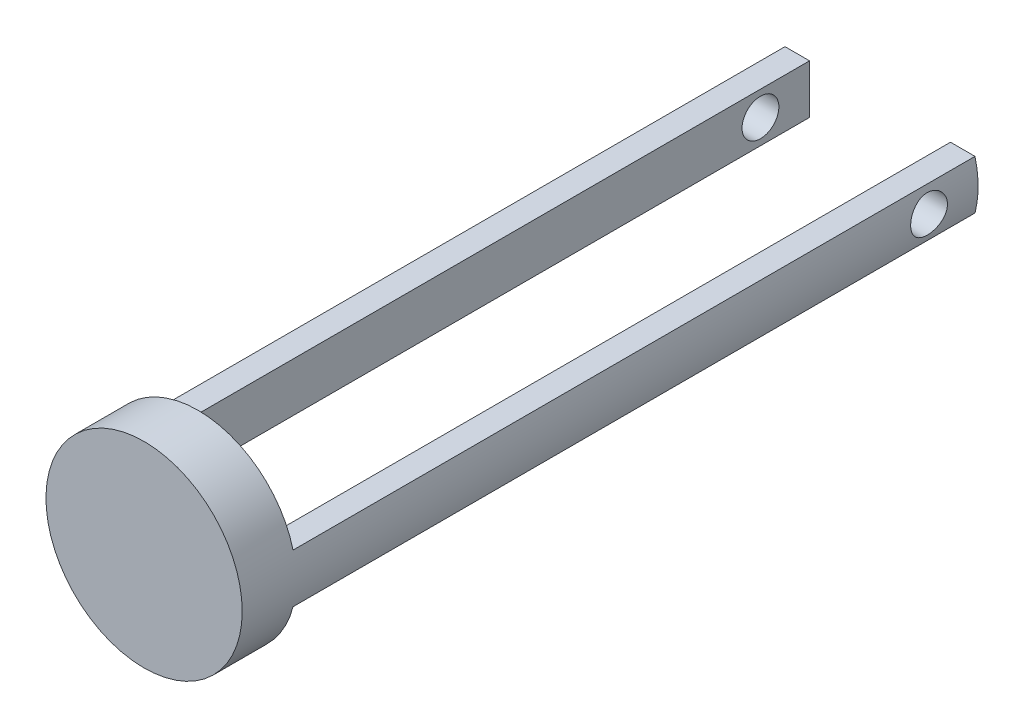
ISO-10303-21;
HEADER;
FILE_DESCRIPTION(('STEP AP214'),'2;1');
FILE_NAME('part.step','',(''),(''),'','','');
FILE_SCHEMA(('AUTOMOTIVE_DESIGN { 1 0 10303 214 1 1 1 1 }'));
ENDSEC;
DATA;
#1=APPLICATION_CONTEXT('core data for automotive mechanical design processes');
#2=APPLICATION_PROTOCOL_DEFINITION('international standard','automotive_design',2000,#1);
#3=PRODUCT_CONTEXT('',#1,'mechanical');
#4=PRODUCT('Part','Part','',(#3));
#5=PRODUCT_RELATED_PRODUCT_CATEGORY('part','',(#4));
#6=PRODUCT_DEFINITION_FORMATION('','',#4);
#7=PRODUCT_DEFINITION_CONTEXT('part definition',#1,'design');
#8=PRODUCT_DEFINITION('design','',#6,#7);
#9=PRODUCT_DEFINITION_SHAPE('','',#8);
#10=(LENGTH_UNIT() NAMED_UNIT(*) SI_UNIT(.MILLI.,.METRE.));
#11=(NAMED_UNIT(*) PLANE_ANGLE_UNIT() SI_UNIT($,.RADIAN.));
#12=(NAMED_UNIT(*) SI_UNIT($,.STERADIAN.) SOLID_ANGLE_UNIT());
#13=UNCERTAINTY_MEASURE_WITH_UNIT(LENGTH_MEASURE(1.E-05),#10,'distance_accuracy_value','');
#14=(GEOMETRIC_REPRESENTATION_CONTEXT(3) GLOBAL_UNCERTAINTY_ASSIGNED_CONTEXT((#13)) GLOBAL_UNIT_ASSIGNED_CONTEXT((#10,
#11,#12)) REPRESENTATION_CONTEXT('',''));
#15=CARTESIAN_POINT('',(0.,0.,0.));
#16=DIRECTION('',(0.,0.,1.));
#17=DIRECTION('',(1.,0.,0.));
#18=AXIS2_PLACEMENT_3D('',#15,#16,#17);
#19=CARTESIAN_POINT('',(0.,0.,0.));
#20=DIRECTION('',(0.,0.,1.));
#21=DIRECTION('',(1.,0.,0.));
#22=AXIS2_PLACEMENT_3D('',#19,#20,#21);
#23=PLANE('',#22);
#24=DIRECTION('',(1.,0.,0.));
#25=VECTOR('',#24,1.);
#26=CARTESIAN_POINT('',(-49.1868884968342,12.7,0.));
#27=LINE('',#26,#25);
#28=CARTESIAN_POINT('',(-49.1868884968342,12.7,0.));
#29=VERTEX_POINT('',#28);
#30=CARTESIAN_POINT('',(-36.4868884968342,12.7,0.));
#31=VERTEX_POINT('',#30);
#32=EDGE_CURVE('E291',#29,#31,#27,.T.);
#33=ORIENTED_EDGE('',*,*,#32,.F.);
#34=CARTESIAN_POINT('',(0.,0.,0.));
#35=DIRECTION('',(0.,0.,1.));
#36=DIRECTION('',(1.,0.,0.));
#37=AXIS2_PLACEMENT_3D('',#34,#35,#36);
#38=CIRCLE('',#37,50.8);
#39=CARTESIAN_POINT('',(49.1868884968342,12.7,0.));
#40=VERTEX_POINT('',#39);
#41=EDGE_CURVE('E43',#40,#29,#38,.T.);
#42=ORIENTED_EDGE('',*,*,#41,.F.);
#43=DIRECTION('',(1.,0.,0.));
#44=VECTOR('',#43,1.);
#45=CARTESIAN_POINT('',(49.1868884968342,12.7,0.));
#46=LINE('',#45,#44);
#47=CARTESIAN_POINT('',(36.4868884968342,12.7,0.));
#48=VERTEX_POINT('',#47);
#49=EDGE_CURVE('E59',#48,#40,#46,.T.);
#50=ORIENTED_EDGE('',*,*,#49,.F.);
#51=DIRECTION('',(0.,1.,0.));
#52=VECTOR('',#51,1.);
#53=CARTESIAN_POINT('',(36.4868884968342,12.7,0.));
#54=LINE('',#53,#52);
#55=CARTESIAN_POINT('',(36.4868884968342,-12.7,0.));
#56=VERTEX_POINT('',#55);
#57=EDGE_CURVE('E124',#56,#48,#54,.T.);
#58=ORIENTED_EDGE('',*,*,#57,.F.);
#59=DIRECTION('',(-1.,0.,0.));
#60=VECTOR('',#59,1.);
#61=CARTESIAN_POINT('',(36.4868884968342,-12.7,0.));
#62=LINE('',#61,#60);
#63=CARTESIAN_POINT('',(49.1868884968342,-12.7,0.));
#64=VERTEX_POINT('',#63);
#65=EDGE_CURVE('E121',#64,#56,#62,.T.);
#66=ORIENTED_EDGE('',*,*,#65,.F.);
#67=CARTESIAN_POINT('',(-49.1868884968342,-12.7,0.));
#68=VERTEX_POINT('',#67);
#69=EDGE_CURVE('E151',#68,#64,#38,.T.);
#70=ORIENTED_EDGE('',*,*,#69,.F.);
#71=DIRECTION('',(-1.,0.,0.));
#72=VECTOR('',#71,1.);
#73=CARTESIAN_POINT('',(-36.4868884968342,-12.7,0.));
#74=LINE('',#73,#72);
#75=CARTESIAN_POINT('',(-36.4868884968342,-12.7,0.));
#76=VERTEX_POINT('',#75);
#77=EDGE_CURVE('E117',#76,#68,#74,.T.);
#78=ORIENTED_EDGE('',*,*,#77,.F.);
#79=DIRECTION('',(0.,-1.,0.));
#80=VECTOR('',#79,1.);
#81=CARTESIAN_POINT('',(-36.4868884968342,12.7,0.));
#82=LINE('',#81,#80);
#83=EDGE_CURVE('E296',#31,#76,#82,.T.);
#84=ORIENTED_EDGE('',*,*,#83,.F.);
#85=EDGE_LOOP('',(#33,#42,#50,#58,#66,#70,#78,#84));
#86=FACE_BOUND('',#85,.T.);
#87=ADVANCED_FACE('F33',(#86),#23,.F.);
#88=CARTESIAN_POINT('',(0.,0.,27.94));
#89=DIRECTION('',(0.,0.,-1.));
#90=DIRECTION('',(-1.,0.,0.));
#91=AXIS2_PLACEMENT_3D('',#88,#89,#90);
#92=CYLINDRICAL_SURFACE('',#91,50.8);
#93=CARTESIAN_POINT('',(-50.8,0.,-337.185));
#94=CARTESIAN_POINT('',(-50.8000023043984,0.265112508847247,-337.185004788771));
#95=CARTESIAN_POINT('',(-50.797920970951,0.530163183869242,-337.173928461929));
#96=CARTESIAN_POINT('',(-50.7896587686576,1.05843450705729,-337.129718641948));
#97=CARTESIAN_POINT('',(-50.7834771603281,1.32165481646295,-337.096581170084));
#98=CARTESIAN_POINT('',(-50.7671781209653,1.84448038090153,-337.008468416572));
#99=CARTESIAN_POINT('',(-50.7570577920175,2.10408282808436,-336.95347705529));
#100=CARTESIAN_POINT('',(-50.7331648032312,2.6176454114376,-336.822085315767));
#101=CARTESIAN_POINT('',(-50.7193920765346,2.87160544422974,-336.745684545618));
#102=CARTESIAN_POINT('',(-50.688591382839,3.37186240146238,-336.572137803644));
#103=CARTESIAN_POINT('',(-50.6715664616592,3.61816624726249,-336.475011232531));
#104=CARTESIAN_POINT('',(-50.6347225267335,4.10166609552222,-336.260691124805));
#105=CARTESIAN_POINT('',(-50.6149034853259,4.33886200778397,-336.143497389524));
#106=CARTESIAN_POINT('',(-50.5730208007042,4.80247152155046,-335.889925997398));
#107=CARTESIAN_POINT('',(-50.5509577817929,5.02888809640677,-335.753553672258));
#108=CARTESIAN_POINT('',(-50.5051766338902,5.46957355155657,-335.462508828752));
#109=CARTESIAN_POINT('',(-50.4814579186527,5.68383807990406,-335.307829814764));
#110=CARTESIAN_POINT('',(-50.4327680579375,6.10085539778906,-334.979585027289));
#111=CARTESIAN_POINT('',(-50.407786507427,6.30346644002778,-334.805840691591));
#112=CARTESIAN_POINT('',(-50.3574838953207,6.69346707062095,-334.441909282304));
#113=CARTESIAN_POINT('',(-50.3321626843611,6.88084968844636,-334.251714760257));
#114=CARTESIAN_POINT('',(-50.2818970109564,7.2390296240496,-333.856229101085));
#115=CARTESIAN_POINT('',(-50.2569525763597,7.4098257209028,-333.650936854577));
#116=CARTESIAN_POINT('',(-50.2081543813486,7.73356504785847,-333.226753919925));
#117=CARTESIAN_POINT('',(-50.1843001322999,7.88651632492305,-333.007869429846));
#118=CARTESIAN_POINT('',(-50.1381535039642,8.17478181829502,-332.556016888366));
#119=CARTESIAN_POINT('',(-50.1158758542568,8.30993784567323,-332.32294636858));
#120=CARTESIAN_POINT('',(-50.073760985975,8.56005533230363,-331.846111783907));
#121=CARTESIAN_POINT('',(-50.0539228358011,8.67502450776012,-331.602351849652));
#122=CARTESIAN_POINT('',(-50.0172588040603,8.88397902900869,-331.105739568071));
#123=CARTESIAN_POINT('',(-50.000433308317,8.9779616874875,-330.852886061124));
#124=CARTESIAN_POINT('',(-49.9702997106796,9.14419435550265,-330.339929307469));
#125=CARTESIAN_POINT('',(-49.9569915629724,9.21644464810364,-330.079826155235));
#126=CARTESIAN_POINT('',(-49.9344250561705,9.33793182357615,-329.557305238289));
#127=CARTESIAN_POINT('',(-49.9251216274816,9.38742527149658,-329.294949061266));
#128=CARTESIAN_POINT('',(-49.910619554215,9.46422671721475,-328.766896539154));
#129=CARTESIAN_POINT('',(-49.9054208811112,9.4915348691906,-328.501200217289));
#130=CARTESIAN_POINT('',(-49.8992841058544,9.52374484120453,-327.968424737124));
#131=CARTESIAN_POINT('',(-49.8983456679073,9.52864842718343,-327.701345689472));
#132=CARTESIAN_POINT('',(-49.9007566535589,9.51601423280106,-327.167739498825));
#133=CARTESIAN_POINT('',(-49.9041060459689,9.49847661567283,-326.90121235183));
#134=CARTESIAN_POINT('',(-49.9149201445867,9.44148142726203,-326.374160137933));
#135=CARTESIAN_POINT('',(-49.9223299738237,9.4023161019449,-326.113602276199));
#136=CARTESIAN_POINT('',(-49.9410115252385,9.30257696494227,-325.59676126616));
#137=CARTESIAN_POINT('',(-49.952283208258,9.24200337033154,-325.340478074538));
#138=CARTESIAN_POINT('',(-49.9783616513505,9.09992177249048,-324.834011060997));
#139=CARTESIAN_POINT('',(-49.9931678728719,9.01841695837157,-324.583826316261));
#140=CARTESIAN_POINT('',(-50.025900060386,8.83504348397212,-324.091141686507));
#141=CARTESIAN_POINT('',(-50.043827186283,8.73316725042239,-323.848644698444));
#142=CARTESIAN_POINT('',(-50.0824031709965,8.50916422712332,-323.371694349798));
#143=CARTESIAN_POINT('',(-50.1030671805106,8.38692365616127,-323.137295660474));
#144=CARTESIAN_POINT('',(-50.1464540322915,8.12348205099001,-322.679599405587));
#145=CARTESIAN_POINT('',(-50.1691769459655,7.98228035908679,-322.456302225463));
#146=CARTESIAN_POINT('',(-50.2160493936172,7.68189318788734,-322.022287945055));
#147=CARTESIAN_POINT('',(-50.2401990266024,7.52270645981547,-321.811571719872));
#148=CARTESIAN_POINT('',(-50.2892571274404,7.18744124079356,-321.40412926588));
#149=CARTESIAN_POINT('',(-50.3141656031193,7.01136257559607,-321.207403181421));
#150=CARTESIAN_POINT('',(-50.3644533747145,6.64058559937809,-320.826256904367));
#151=CARTESIAN_POINT('',(-50.3898338939651,6.44563715859383,-320.642080107528));
#152=CARTESIAN_POINT('',(-50.4399594753772,6.04086631926162,-320.290782202942));
#153=CARTESIAN_POINT('',(-50.4647045496383,5.8310442042146,-320.123660770257));
#154=CARTESIAN_POINT('',(-50.5128705142384,5.39790651730755,-319.807604203863));
#155=CARTESIAN_POINT('',(-50.5362911136604,5.17458800311414,-319.65867305733));
#156=CARTESIAN_POINT('',(-50.5811352341607,4.7161191915141,-319.380159564345));
#157=CARTESIAN_POINT('',(-50.6025595107767,4.48097342261374,-319.250569886563));
#158=CARTESIAN_POINT('',(-50.642846342037,4.00005209290043,-319.011449390228));
#159=CARTESIAN_POINT('',(-50.6617051279077,3.75426157828497,-318.901948001382));
#160=CARTESIAN_POINT('',(-50.696288210239,3.25410388481664,-318.704065616789));
#161=CARTESIAN_POINT('',(-50.7120124983682,2.99973668316923,-318.615684677179));
#162=CARTESIAN_POINT('',(-50.739875793157,2.48427299353883,-318.460737333101));
#163=CARTESIAN_POINT('',(-50.7520151103627,2.22317709055709,-318.394169039071));
#164=CARTESIAN_POINT('',(-50.7723611085094,1.69613833043521,-318.283366890135));
#165=CARTESIAN_POINT('',(-50.7805678424126,1.43019553862066,-318.239132734442));
#166=CARTESIAN_POINT('',(-50.7927215017215,0.89937681666319,-318.173841893251));
#167=CARTESIAN_POINT('',(-50.7967295717891,0.634543174935049,-318.152452430441));
#168=CARTESIAN_POINT('',(-50.8005862157543,0.10398561005275,-318.131868563183));
#169=CARTESIAN_POINT('',(-50.8004348305161,-0.16173830432938,-318.132673940685));
#170=CARTESIAN_POINT('',(-50.7959769547956,-0.692142454708572,-318.156472488089));
#171=CARTESIAN_POINT('',(-50.7916706561851,-0.956822738333285,-318.179464633417));
#172=CARTESIAN_POINT('',(-50.7790243149838,-1.48324346441208,-318.247452586734));
#173=CARTESIAN_POINT('',(-50.7706842789728,-1.74498391166094,-318.292448358831));
#174=CARTESIAN_POINT('',(-50.7502864886563,-2.26157303900356,-318.403642119171));
#175=CARTESIAN_POINT('',(-50.738259050563,-2.51646013039425,-318.469667378258));
#176=CARTESIAN_POINT('',(-50.7107902430649,-3.01981997740712,-318.62254881302));
#177=CARTESIAN_POINT('',(-50.6953476282127,-3.26829035596947,-318.709412589071));
#178=CARTESIAN_POINT('',(-50.6614752624652,-3.75698213375344,-318.903299463681));
#179=CARTESIAN_POINT('',(-50.6430459421786,-3.99720471606091,-319.010319656544));
#180=CARTESIAN_POINT('',(-50.6036984790553,-4.46782594571761,-319.243756521543));
#181=CARTESIAN_POINT('',(-50.5827802620486,-4.69822430002294,-319.370173771752));
#182=CARTESIAN_POINT('',(-50.5387816917786,-5.15011130656709,-319.642993489899));
#183=CARTESIAN_POINT('',(-50.515680254336,-5.37147545156087,-319.789598799169));
#184=CARTESIAN_POINT('',(-50.4681465233909,-5.80111284871436,-320.100697034103));
#185=CARTESIAN_POINT('',(-50.4437141825509,-6.00938563467257,-320.265190596225));
#186=CARTESIAN_POINT('',(-50.3941943441381,-6.41141160413162,-320.610907716413));
#187=CARTESIAN_POINT('',(-50.3691069427881,-6.60516690412746,-320.79212882715));
#188=CARTESIAN_POINT('',(-50.3189530919444,-6.97697454920344,-321.170179248127));
#189=CARTESIAN_POINT('',(-50.2938866562871,-7.15502003601336,-321.367015304709));
#190=CARTESIAN_POINT('',(-50.2441499112786,-7.4963692698822,-321.777628280849));
#191=CARTESIAN_POINT('',(-50.2194893197271,-7.65944517668601,-321.991595864147));
#192=CARTESIAN_POINT('',(-50.1716296386834,-7.96691826070194,-322.432567052964));
#193=CARTESIAN_POINT('',(-50.1484299013601,-8.11132374785976,-322.659564793526));
#194=CARTESIAN_POINT('',(-50.104141240561,-8.38055242541835,-323.12520997076));
#195=CARTESIAN_POINT('',(-50.0830531538089,-8.50536786445648,-323.363861970047));
#196=CARTESIAN_POINT('',(-50.0436227916385,-8.73437587257322,-323.8509707958));
#197=CARTESIAN_POINT('',(-50.0252794500894,-8.83857645409465,-324.099423767678));
#198=CARTESIAN_POINT('',(-49.991949819316,-9.02518153236795,-324.603276768453));
#199=CARTESIAN_POINT('',(-49.9769482198188,-9.1076857592939,-324.858638840405));
#200=CARTESIAN_POINT('',(-49.9506382617657,-9.25089425026564,-325.375592777864));
#201=CARTESIAN_POINT('',(-49.9393298965773,-9.31159855346105,-325.637184632183));
#202=CARTESIAN_POINT('',(-49.9207462929837,-9.41071923612406,-326.164674298093));
#203=CARTESIAN_POINT('',(-49.9134706721004,-9.44913772926408,-326.430571698868));
#204=CARTESIAN_POINT('',(-49.9031708172262,-9.50338405002132,-326.964741779703));
#205=CARTESIAN_POINT('',(-49.9001465311871,-9.51921215420785,-327.233014430641));
#206=CARTESIAN_POINT('',(-49.8984542616847,-9.52807846391424,-327.765678460987));
#207=CARTESIAN_POINT('',(-49.8997177737947,-9.52147504712337,-328.030063726472));
#208=CARTESIAN_POINT('',(-49.9064130476676,-9.48631941860531,-328.557315281026));
#209=CARTESIAN_POINT('',(-49.9118447625194,-9.45776745389854,-328.820181587157));
#210=CARTESIAN_POINT('',(-49.926717096315,-9.37894048458691,-329.3425167859));
#211=CARTESIAN_POINT('',(-49.9361576704896,-9.32866572257262,-329.601985716418));
#212=CARTESIAN_POINT('',(-49.9587726900808,-9.20678377990472,-330.115696825685));
#213=CARTESIAN_POINT('',(-49.9719471496636,-9.1351765183173,-330.369938984601));
#214=CARTESIAN_POINT('',(-50.0016187853871,-8.97134480108404,-330.870904367681));
#215=CARTESIAN_POINT('',(-50.0181090291021,-8.87916331717317,-331.117642062716));
#216=CARTESIAN_POINT('',(-50.0539668008581,-8.67474334449546,-331.602551240393));
#217=CARTESIAN_POINT('',(-50.0733353765474,-8.56249754973949,-331.840719564606));
#218=CARTESIAN_POINT('',(-50.1143979526182,-8.31879655674637,-332.306760783255));
#219=CARTESIAN_POINT('',(-50.1360916183645,-8.18734412181117,-332.534635152542));
#220=CARTESIAN_POINT('',(-50.1812049197008,-7.90613329306919,-332.978621672288));
#221=CARTESIAN_POINT('',(-50.2046246178186,-7.75637423595312,-333.194733396138));
#222=CARTESIAN_POINT('',(-50.2529049722162,-7.43720184527718,-333.616905358862));
#223=CARTESIAN_POINT('',(-50.2777819490969,-7.26752789278039,-333.822766744573));
#224=CARTESIAN_POINT('',(-50.3279528969357,-6.91154528184576,-334.219512292951));
#225=CARTESIAN_POINT('',(-50.35324687181,-6.72523646711122,-334.410396314864));
#226=CARTESIAN_POINT('',(-50.4035526251452,-6.33720415994269,-334.775935026492));
#227=CARTESIAN_POINT('',(-50.4285643347533,-6.1354769959658,-334.950585828542));
#228=CARTESIAN_POINT('',(-50.4776034723741,-5.71801609618882,-335.282401850466));
#229=CARTESIAN_POINT('',(-50.5016309227513,-5.50228267892913,-335.43956746778));
#230=CARTESIAN_POINT('',(-50.5482487447998,-5.05621262901417,-335.736683123775));
#231=CARTESIAN_POINT('',(-50.5708238094437,-4.82575961122899,-335.876460917954));
#232=CARTESIAN_POINT('',(-50.613643474036,-4.35376001505356,-336.136020007218));
#233=CARTESIAN_POINT('',(-50.6338889285696,-4.11221755045537,-336.255808642356));
#234=CARTESIAN_POINT('',(-50.6714702872972,-3.61980641448794,-336.474484447015));
#235=CARTESIAN_POINT('',(-50.6888080553392,-3.3689438443392,-336.573385016564));
#236=CARTESIAN_POINT('',(-50.7200912824853,-2.85963023555814,-336.749597095273));
#237=CARTESIAN_POINT('',(-50.7340374247102,-2.60118073681125,-336.826912952359));
#238=CARTESIAN_POINT('',(-50.7636794180959,-1.95817812885178,-336.989844559949));
#239=CARTESIAN_POINT('',(-50.777231781538,-1.57027857459066,-337.062933251594));
#240=CARTESIAN_POINT('',(-50.7953902462665,-0.78820704197528,-337.160506795051));
#241=CARTESIAN_POINT('',(-50.7999965749857,-0.394035223336034,-337.184992882476));
#242=CARTESIAN_POINT('',(-50.8,0.,-337.185));
#243=B_SPLINE_CURVE_WITH_KNOTS('',3,(#93,#94,#95,#96,#97,#98,#99,#100,#101,#102,#103,#104,#105,
#106,#107,#108,#109,#110,#111,#112,#113,#114,#115,#116,#117,#118,#119,#120,#121,#122,#123,#124,
#125,#126,#127,#128,#129,#130,#131,#132,#133,#134,#135,#136,#137,#138,#139,#140,#141,#142,#143,
#144,#145,#146,#147,#148,#149,#150,#151,#152,#153,#154,#155,#156,#157,#158,#159,#160,#161,#162,
#163,#164,#165,#166,#167,#168,#169,#170,#171,#172,#173,#174,#175,#176,#177,#178,#179,#180,#181,
#182,#183,#184,#185,#186,#187,#188,#189,#190,#191,#192,#193,#194,#195,#196,#197,#198,#199,#200,
#201,#202,#203,#204,#205,#206,#207,#208,#209,#210,#211,#212,#213,#214,#215,#216,#217,#218,#219,
#220,#221,#222,#223,#224,#225,#226,#227,#228,#229,#230,#231,#232,#233,#234,#235,#236,#237,#238,
#239,#240,#241,#242),.UNSPECIFIED.,.T.,.F.,(4,2,2,2,2,2,2,2,2,2,2,2,2,2,2,2,2,2,2,2,2,2,2,2,2,2,
2,2,2,2,2,2,2,2,2,2,2,2,2,2,2,2,2,2,2,2,2,2,2,2,2,2,2,2,2,2,2,2,2,2,2,2,2,2,2,2,2,2,2,2,2,2,2,2,
4),(0.,0.794991771814218,1.59012695919119,2.38584827678684,3.18158416129831,3.97657842678294,
4.77158056324146,5.56636212199542,6.36142653720992,7.16470232685948,7.96834375413343,
8.77204429223996,9.57538099639204,10.3854357195156,11.1951801307728,12.0050281700247,
12.8148656605273,13.6153344060371,14.4157975885915,15.2161976770868,16.0165919436571,
16.8064264836542,17.5962530151465,18.3859592788276,19.1759596709774,19.9705319202776,
20.7651317375924,21.5597867612142,22.3544499829188,23.1616625319108,23.9688596990948,
24.7762334816187,25.5833004498995,26.3915405049139,27.1997827081837,28.0079548774171,
28.8161161622785,29.6123373617529,30.4085507388439,31.2047273489401,32.0009026603102,
32.7907001544658,33.5807861484612,34.3707583328656,35.1607540646483,35.9593617628146,
36.7579978844181,37.5565173459033,38.3553837015661,39.1648864889183,39.9740277282663,
40.7834883247114,41.5926336847315,42.3979919825268,43.2033488340037,44.0086292898274,
44.8138998866897,45.6063659655105,46.3988231256346,47.1912714361773,47.9837227532444,
48.7745341768051,49.565634146179,50.3566204101137,51.1476353425888,51.9504894513916,
52.7533511043897,53.5564045405863,54.3594397195504,55.1698851294529,55.9800322844439,
56.7896581277674,57.5991207658433,58.7807425830139,59.9623343597249),.UNSPECIFIED.);
#244=CARTESIAN_POINT('',(-50.8,0.,-337.185));
#245=VERTEX_POINT('',#244);
#246=EDGE_CURVE('E287',#245,#245,#243,.T.);
#247=ORIENTED_EDGE('',*,*,#246,.T.);
#248=EDGE_LOOP('',(#247));
#249=FACE_BOUND('',#248,.T.);
#250=CARTESIAN_POINT('',(50.8,0.,-337.185));
#251=CARTESIAN_POINT('',(50.8000023043984,-0.265112508847248,-337.185004788771));
#252=CARTESIAN_POINT('',(50.797920970951,-0.530163183869243,-337.173928461929));
#253=CARTESIAN_POINT('',(50.7896587686576,-1.05843450705729,-337.129718641948));
#254=CARTESIAN_POINT('',(50.7834771603281,-1.32165481646295,-337.096581170084));
#255=CARTESIAN_POINT('',(50.7671781209653,-1.84448038090154,-337.008468416572));
#256=CARTESIAN_POINT('',(50.7570577920175,-2.10408282808436,-336.95347705529));
#257=CARTESIAN_POINT('',(50.7331648032312,-2.6176454114376,-336.822085315767));
#258=CARTESIAN_POINT('',(50.7193920765346,-2.87160544422974,-336.745684545618));
#259=CARTESIAN_POINT('',(50.688591382839,-3.37186240146238,-336.572137803644));
#260=CARTESIAN_POINT('',(50.6715664616592,-3.61816624726249,-336.475011232531));
#261=CARTESIAN_POINT('',(50.6347225267335,-4.10166609552222,-336.260691124805));
#262=CARTESIAN_POINT('',(50.6149034853259,-4.33886200778397,-336.143497389524));
#263=CARTESIAN_POINT('',(50.5730208007042,-4.80247152155046,-335.889925997398));
#264=CARTESIAN_POINT('',(50.5509577817929,-5.02888809640677,-335.753553672258));
#265=CARTESIAN_POINT('',(50.5051766338902,-5.46957355155657,-335.462508828752));
#266=CARTESIAN_POINT('',(50.4814579186527,-5.68383807990406,-335.307829814764));
#267=CARTESIAN_POINT('',(50.4327680579375,-6.10085539778906,-334.979585027289));
#268=CARTESIAN_POINT('',(50.407786507427,-6.30346644002778,-334.805840691591));
#269=CARTESIAN_POINT('',(50.3574838953207,-6.69346707062095,-334.441909282304));
#270=CARTESIAN_POINT('',(50.3321626843611,-6.88084968844636,-334.251714760257));
#271=CARTESIAN_POINT('',(50.2818970109564,-7.2390296240496,-333.856229101085));
#272=CARTESIAN_POINT('',(50.2569525763597,-7.4098257209028,-333.650936854577));
#273=CARTESIAN_POINT('',(50.2081543813486,-7.73356504785847,-333.226753919925));
#274=CARTESIAN_POINT('',(50.1843001322999,-7.88651632492305,-333.007869429846));
#275=CARTESIAN_POINT('',(50.1381535039642,-8.17478181829502,-332.556016888366));
#276=CARTESIAN_POINT('',(50.1158758542569,-8.30993784567323,-332.32294636858));
#277=CARTESIAN_POINT('',(50.0737609859751,-8.56005533230363,-331.846111783907));
#278=CARTESIAN_POINT('',(50.0539228358011,-8.67502450776012,-331.602351849652));
#279=CARTESIAN_POINT('',(50.0172588040603,-8.88397902900869,-331.105739568071));
#280=CARTESIAN_POINT('',(50.000433308317,-8.9779616874875,-330.852886061124));
#281=CARTESIAN_POINT('',(49.9702997106796,-9.14419435550265,-330.339929307469));
#282=CARTESIAN_POINT('',(49.9569915629724,-9.21644464810364,-330.079826155235));
#283=CARTESIAN_POINT('',(49.9344250561705,-9.33793182357615,-329.557305238289));
#284=CARTESIAN_POINT('',(49.9251216274816,-9.38742527149658,-329.294949061266));
#285=CARTESIAN_POINT('',(49.910619554215,-9.46422671721475,-328.766896539154));
#286=CARTESIAN_POINT('',(49.9054208811112,-9.4915348691906,-328.501200217289));
#287=CARTESIAN_POINT('',(49.8992841058544,-9.52374484120453,-327.968424737124));
#288=CARTESIAN_POINT('',(49.8983456679073,-9.52864842718343,-327.701345689472));
#289=CARTESIAN_POINT('',(49.9007566535589,-9.51601423280106,-327.167739498825));
#290=CARTESIAN_POINT('',(49.9041060459689,-9.49847661567283,-326.90121235183));
#291=CARTESIAN_POINT('',(49.9149201445867,-9.44148142726203,-326.374160137933));
#292=CARTESIAN_POINT('',(49.9223299738237,-9.4023161019449,-326.113602276199));
#293=CARTESIAN_POINT('',(49.9410115252385,-9.30257696494227,-325.59676126616));
#294=CARTESIAN_POINT('',(49.952283208258,-9.24200337033154,-325.340478074538));
#295=CARTESIAN_POINT('',(49.9783616513505,-9.09992177249048,-324.834011060997));
#296=CARTESIAN_POINT('',(49.9931678728719,-9.01841695837157,-324.583826316261));
#297=CARTESIAN_POINT('',(50.025900060386,-8.83504348397212,-324.091141686507));
#298=CARTESIAN_POINT('',(50.043827186283,-8.73316725042239,-323.848644698444));
#299=CARTESIAN_POINT('',(50.0824031709965,-8.50916422712332,-323.371694349798));
#300=CARTESIAN_POINT('',(50.1030671805106,-8.38692365616127,-323.137295660474));
#301=CARTESIAN_POINT('',(50.1464540322915,-8.12348205099001,-322.679599405587));
#302=CARTESIAN_POINT('',(50.1691769459655,-7.98228035908679,-322.456302225463));
#303=CARTESIAN_POINT('',(50.2160493936172,-7.68189318788734,-322.022287945055));
#304=CARTESIAN_POINT('',(50.2401990266024,-7.52270645981547,-321.811571719872));
#305=CARTESIAN_POINT('',(50.2892571274404,-7.18744124079356,-321.40412926588));
#306=CARTESIAN_POINT('',(50.3141656031193,-7.01136257559607,-321.207403181421));
#307=CARTESIAN_POINT('',(50.3644533747145,-6.6405855993781,-320.826256904367));
#308=CARTESIAN_POINT('',(50.3898338939651,-6.44563715859383,-320.642080107528));
#309=CARTESIAN_POINT('',(50.4399594753772,-6.04086631926162,-320.290782202942));
#310=CARTESIAN_POINT('',(50.4647045496383,-5.8310442042146,-320.123660770257));
#311=CARTESIAN_POINT('',(50.5128705142384,-5.39790651730755,-319.807604203863));
#312=CARTESIAN_POINT('',(50.5362911136604,-5.17458800311412,-319.65867305733));
#313=CARTESIAN_POINT('',(50.5811352341607,-4.71611919151408,-319.380159564345));
#314=CARTESIAN_POINT('',(50.6025595107767,-4.48097342261373,-319.250569886563));
#315=CARTESIAN_POINT('',(50.642846342037,-4.00005209290043,-319.011449390228));
#316=CARTESIAN_POINT('',(50.6617051279077,-3.75426157828497,-318.901948001382));
#317=CARTESIAN_POINT('',(50.696288210239,-3.25410388481664,-318.704065616789));
#318=CARTESIAN_POINT('',(50.7120124983682,-2.99973668316923,-318.615684677179));
#319=CARTESIAN_POINT('',(50.7398757931571,-2.48427299353883,-318.460737333101));
#320=CARTESIAN_POINT('',(50.7520151103627,-2.22317709055709,-318.394169039071));
#321=CARTESIAN_POINT('',(50.7723611085094,-1.69613833043521,-318.283366890135));
#322=CARTESIAN_POINT('',(50.7805678424126,-1.43019553862067,-318.239132734442));
#323=CARTESIAN_POINT('',(50.7927215017215,-0.899376816663191,-318.173841893251));
#324=CARTESIAN_POINT('',(50.7967295717891,-0.63454317493505,-318.152452430441));
#325=CARTESIAN_POINT('',(50.8005862157543,-0.10398561005275,-318.131868563183));
#326=CARTESIAN_POINT('',(50.8004348305161,0.16173830432938,-318.132673940685));
#327=CARTESIAN_POINT('',(50.7959769547956,0.692142454708572,-318.156472488089));
#328=CARTESIAN_POINT('',(50.7916706561851,0.956822738333284,-318.179464633417));
#329=CARTESIAN_POINT('',(50.7790243149838,1.48324346441208,-318.247452586734));
#330=CARTESIAN_POINT('',(50.7706842789728,1.74498391166094,-318.292448358831));
#331=CARTESIAN_POINT('',(50.7502864886563,2.26157303900356,-318.403642119171));
#332=CARTESIAN_POINT('',(50.738259050563,2.51646013039425,-318.469667378258));
#333=CARTESIAN_POINT('',(50.7107902430649,3.01981997740712,-318.62254881302));
#334=CARTESIAN_POINT('',(50.6953476282127,3.26829035596946,-318.709412589071));
#335=CARTESIAN_POINT('',(50.6614752624652,3.75698213375343,-318.903299463681));
#336=CARTESIAN_POINT('',(50.6430459421786,3.9972047160609,-319.010319656544));
#337=CARTESIAN_POINT('',(50.6036984790553,4.46782594571761,-319.243756521543));
#338=CARTESIAN_POINT('',(50.5827802620486,4.69822430002295,-319.370173771752));
#339=CARTESIAN_POINT('',(50.5387816917786,5.15011130656712,-319.642993489899));
#340=CARTESIAN_POINT('',(50.515680254336,5.37147545156092,-319.789598799169));
#341=CARTESIAN_POINT('',(50.4681465233909,5.80111284871441,-320.100697034103));
#342=CARTESIAN_POINT('',(50.4437141825509,6.0093856346726,-320.265190596225));
#343=CARTESIAN_POINT('',(50.3941943441381,6.41141160413162,-320.610907716413));
#344=CARTESIAN_POINT('',(50.3691069427881,6.60516690412746,-320.79212882715));
#345=CARTESIAN_POINT('',(50.3189530919444,6.97697454920344,-321.170179248127));
#346=CARTESIAN_POINT('',(50.2938866562871,7.15502003601336,-321.367015304709));
#347=CARTESIAN_POINT('',(50.2441499112786,7.4963692698822,-321.777628280849));
#348=CARTESIAN_POINT('',(50.2194893197271,7.65944517668601,-321.991595864147));
#349=CARTESIAN_POINT('',(50.1716296386834,7.96691826070194,-322.432567052964));
#350=CARTESIAN_POINT('',(50.1484299013601,8.11132374785976,-322.659564793526));
#351=CARTESIAN_POINT('',(50.104141240561,8.38055242541835,-323.12520997076));
#352=CARTESIAN_POINT('',(50.0830531538089,8.50536786445648,-323.363861970047));
#353=CARTESIAN_POINT('',(50.0436227916385,8.73437587257322,-323.8509707958));
#354=CARTESIAN_POINT('',(50.0252794500894,8.83857645409465,-324.099423767678));
#355=CARTESIAN_POINT('',(49.991949819316,9.02518153236795,-324.603276768453));
#356=CARTESIAN_POINT('',(49.9769482198188,9.1076857592939,-324.858638840405));
#357=CARTESIAN_POINT('',(49.9506382617657,9.25089425026564,-325.375592777864));
#358=CARTESIAN_POINT('',(49.9393298965773,9.31159855346105,-325.637184632183));
#359=CARTESIAN_POINT('',(49.9207462929837,9.41071923612406,-326.164674298093));
#360=CARTESIAN_POINT('',(49.9134706721004,9.44913772926408,-326.430571698868));
#361=CARTESIAN_POINT('',(49.9031708172262,9.50338405002132,-326.964741779703));
#362=CARTESIAN_POINT('',(49.9001465311871,9.51921215420785,-327.233014430641));
#363=CARTESIAN_POINT('',(49.8984542616847,9.52807846391424,-327.765678460987));
#364=CARTESIAN_POINT('',(49.8997177737947,9.52147504712337,-328.030063726472));
#365=CARTESIAN_POINT('',(49.9064130476676,9.48631941860531,-328.557315281026));
#366=CARTESIAN_POINT('',(49.9118447625194,9.45776745389854,-328.820181587157));
#367=CARTESIAN_POINT('',(49.926717096315,9.37894048458691,-329.3425167859));
#368=CARTESIAN_POINT('',(49.9361576704896,9.32866572257262,-329.601985716418));
#369=CARTESIAN_POINT('',(49.9587726900808,9.20678377990472,-330.115696825685));
#370=CARTESIAN_POINT('',(49.9719471496636,9.1351765183173,-330.369938984601));
#371=CARTESIAN_POINT('',(50.0016187853871,8.97134480108404,-330.870904367681));
#372=CARTESIAN_POINT('',(50.0181090291021,8.87916331717317,-331.117642062716));
#373=CARTESIAN_POINT('',(50.0539668008581,8.67474334449546,-331.602551240393));
#374=CARTESIAN_POINT('',(50.0733353765474,8.56249754973948,-331.840719564606));
#375=CARTESIAN_POINT('',(50.1143979526182,8.31879655674637,-332.306760783255));
#376=CARTESIAN_POINT('',(50.1360916183645,8.18734412181117,-332.534635152542));
#377=CARTESIAN_POINT('',(50.1812049197008,7.90613329306919,-332.978621672288));
#378=CARTESIAN_POINT('',(50.2046246178186,7.75637423595312,-333.194733396138));
#379=CARTESIAN_POINT('',(50.2529049722162,7.43720184527718,-333.616905358862));
#380=CARTESIAN_POINT('',(50.2777819490969,7.26752789278039,-333.822766744573));
#381=CARTESIAN_POINT('',(50.3279528969357,6.91154528184576,-334.219512292951));
#382=CARTESIAN_POINT('',(50.35324687181,6.72523646711122,-334.410396314864));
#383=CARTESIAN_POINT('',(50.4035526251452,6.33720415994269,-334.775935026492));
#384=CARTESIAN_POINT('',(50.4285643347533,6.13547699596581,-334.950585828542));
#385=CARTESIAN_POINT('',(50.4776034723741,5.71801609618882,-335.282401850466));
#386=CARTESIAN_POINT('',(50.5016309227513,5.50228267892913,-335.43956746778));
#387=CARTESIAN_POINT('',(50.5482487447998,5.05621262901417,-335.736683123775));
#388=CARTESIAN_POINT('',(50.5708238094437,4.82575961122899,-335.876460917954));
#389=CARTESIAN_POINT('',(50.613643474036,4.35376001505356,-336.136020007218));
#390=CARTESIAN_POINT('',(50.6338889285696,4.11221755045537,-336.255808642356));
#391=CARTESIAN_POINT('',(50.6714702872972,3.61980641448795,-336.474484447015));
#392=CARTESIAN_POINT('',(50.6888080553392,3.3689438443392,-336.573385016564));
#393=CARTESIAN_POINT('',(50.7200912824853,2.85963023555815,-336.749597095273));
#394=CARTESIAN_POINT('',(50.7340374247102,2.60118073681125,-336.826912952359));
#395=CARTESIAN_POINT('',(50.7636794180959,1.95817812885178,-336.989844559949));
#396=CARTESIAN_POINT('',(50.777231781538,1.57027857459067,-337.062933251594));
#397=CARTESIAN_POINT('',(50.7953902462665,0.788207041975287,-337.160506795051));
#398=CARTESIAN_POINT('',(50.7999965749857,0.394035223336037,-337.184992882476));
#399=CARTESIAN_POINT('',(50.8,0.,-337.185));
#400=B_SPLINE_CURVE_WITH_KNOTS('',3,(#250,#251,#252,#253,#254,#255,#256,#257,#258,#259,#260,
#261,#262,#263,#264,#265,#266,#267,#268,#269,#270,#271,#272,#273,#274,#275,#276,#277,#278,#279,
#280,#281,#282,#283,#284,#285,#286,#287,#288,#289,#290,#291,#292,#293,#294,#295,#296,#297,#298,
#299,#300,#301,#302,#303,#304,#305,#306,#307,#308,#309,#310,#311,#312,#313,#314,#315,#316,#317,
#318,#319,#320,#321,#322,#323,#324,#325,#326,#327,#328,#329,#330,#331,#332,#333,#334,#335,#336,
#337,#338,#339,#340,#341,#342,#343,#344,#345,#346,#347,#348,#349,#350,#351,#352,#353,#354,#355,
#356,#357,#358,#359,#360,#361,#362,#363,#364,#365,#366,#367,#368,#369,#370,#371,#372,#373,#374,
#375,#376,#377,#378,#379,#380,#381,#382,#383,#384,#385,#386,#387,#388,#389,#390,#391,#392,#393,
#394,#395,#396,#397,#398,#399),.UNSPECIFIED.,.T.,.F.,(4,2,2,2,2,2,2,2,2,2,2,2,2,2,2,2,2,2,2,2,2,
2,2,2,2,2,2,2,2,2,2,2,2,2,2,2,2,2,2,2,2,2,2,2,2,2,2,2,2,2,2,2,2,2,2,2,2,2,2,2,2,2,2,2,2,2,2,2,2,
2,2,2,2,2,4),(0.,0.79499177181422,1.59012695919119,2.38584827678684,3.18158416129831,
3.97657842678294,4.77158056324146,5.56636212199542,6.36142653720992,7.16470232685948,
7.96834375413343,8.77204429223996,9.57538099639204,10.3854357195156,11.1951801307728,
12.0050281700247,12.8148656605273,13.6153344060371,14.4157975885915,15.2161976770868,
16.0165919436571,16.8064264836542,17.5962530151465,18.3859592788276,19.1759596709774,
19.9705319202776,20.7651317375924,21.5597867612142,22.3544499829188,23.1616625319108,
23.9688596990949,24.7762334816187,25.5833004498995,26.3915405049139,27.1997827081837,
28.0079548774171,28.8161161622785,29.6123373617529,30.4085507388439,31.2047273489401,
32.0009026603101,32.7907001544658,33.5807861484612,34.3707583328656,35.1607540646483,
35.9593617628147,36.7579978844181,37.5565173459033,38.3553837015661,39.1648864889183,
39.9740277282663,40.7834883247114,41.5926336847315,42.3979919825268,43.2033488340037,
44.0086292898274,44.8138998866897,45.6063659655105,46.3988231256346,47.1912714361773,
47.9837227532444,48.7745341768051,49.565634146179,50.3566204101137,51.1476353425888,
51.9504894513916,52.7533511043897,53.5564045405863,54.3594397195504,55.1698851294529,
55.9800322844439,56.7896581277674,57.5991207658433,58.7807425830139,59.9623343597249),.UNSPECIFIED.);
#401=CARTESIAN_POINT('',(50.8,0.,-337.185));
#402=VERTEX_POINT('',#401);
#403=EDGE_CURVE('E282',#402,#402,#400,.T.);
#404=ORIENTED_EDGE('',*,*,#403,.T.);
#405=EDGE_LOOP('',(#404));
#406=FACE_BOUND('',#405,.T.);
#407=CARTESIAN_POINT('',(0.,0.,27.94));
#408=DIRECTION('',(0.,0.,1.));
#409=DIRECTION('',(1.,0.,0.));
#410=AXIS2_PLACEMENT_3D('',#407,#408,#409);
#411=CIRCLE('',#410,50.8);
#412=CARTESIAN_POINT('',(50.8,0.,27.94));
#413=VERTEX_POINT('',#412);
#414=EDGE_CURVE('E11',#413,#413,#411,.T.);
#415=ORIENTED_EDGE('',*,*,#414,.F.);
#416=EDGE_LOOP('',(#415));
#417=FACE_BOUND('',#416,.T.);
#418=ORIENTED_EDGE('',*,*,#41,.T.);
#419=DIRECTION('',(0.,0.,1.));
#420=VECTOR('',#419,1.);
#421=CARTESIAN_POINT('',(-49.1868884968342,12.7,-353.06));
#422=LINE('',#421,#420);
#423=CARTESIAN_POINT('',(-49.1868884968342,12.7,-353.06));
#424=VERTEX_POINT('',#423);
#425=EDGE_CURVE('E105',#424,#29,#422,.T.);
#426=ORIENTED_EDGE('',*,*,#425,.F.);
#427=CARTESIAN_POINT('',(0.,0.,-353.06));
#428=DIRECTION('',(0.,0.,-1.));
#429=DIRECTION('',(1.,0.,0.));
#430=AXIS2_PLACEMENT_3D('',#427,#428,#429);
#431=CIRCLE('',#430,50.8);
#432=CARTESIAN_POINT('',(-49.1868884968342,-12.7,-353.06));
#433=VERTEX_POINT('',#432);
#434=EDGE_CURVE('E112',#433,#424,#431,.T.);
#435=ORIENTED_EDGE('',*,*,#434,.F.);
#436=DIRECTION('',(0.,0.,1.));
#437=VECTOR('',#436,1.);
#438=CARTESIAN_POINT('',(-49.1868884968342,-12.7,-353.06));
#439=LINE('',#438,#437);
#440=EDGE_CURVE('E51',#433,#68,#439,.T.);
#441=ORIENTED_EDGE('',*,*,#440,.T.);
#442=ORIENTED_EDGE('',*,*,#69,.T.);
#443=DIRECTION('',(0.,0.,1.));
#444=VECTOR('',#443,1.);
#445=CARTESIAN_POINT('',(49.1868884968342,-12.7,-353.06));
#446=LINE('',#445,#444);
#447=CARTESIAN_POINT('',(49.1868884968342,-12.7,-353.06));
#448=VERTEX_POINT('',#447);
#449=EDGE_CURVE('E149',#448,#64,#446,.T.);
#450=ORIENTED_EDGE('',*,*,#449,.F.);
#451=CARTESIAN_POINT('',(0.,0.,-353.06));
#452=DIRECTION('',(0.,0.,-1.));
#453=DIRECTION('',(-1.,0.,0.));
#454=AXIS2_PLACEMENT_3D('',#451,#452,#453);
#455=CIRCLE('',#454,50.8);
#456=CARTESIAN_POINT('',(49.1868884968342,12.7,-353.06));
#457=VERTEX_POINT('',#456);
#458=EDGE_CURVE('E130',#457,#448,#455,.T.);
#459=ORIENTED_EDGE('',*,*,#458,.F.);
#460=DIRECTION('',(0.,0.,1.));
#461=VECTOR('',#460,1.);
#462=CARTESIAN_POINT('',(49.1868884968342,12.7,-353.06));
#463=LINE('',#462,#461);
#464=EDGE_CURVE('E138',#457,#40,#463,.T.);
#465=ORIENTED_EDGE('',*,*,#464,.T.);
#466=EDGE_LOOP('',(#418,#426,#435,#441,#442,#450,#459,#465));
#467=FACE_BOUND('',#466,.T.);
#468=ADVANCED_FACE('F35',(#249,#406,#417,#467),#92,.T.);
#469=CARTESIAN_POINT('',(0.,0.,27.94));
#470=DIRECTION('',(0.,0.,1.));
#471=DIRECTION('',(1.,0.,0.));
#472=AXIS2_PLACEMENT_3D('',#469,#470,#471);
#473=PLANE('',#472);
#474=ORIENTED_EDGE('',*,*,#414,.T.);
#475=EDGE_LOOP('',(#474));
#476=FACE_BOUND('',#475,.T.);
#477=ADVANCED_FACE('F180',(#476),#473,.T.);
#478=CARTESIAN_POINT('',(36.4868884968342,-12.7,-353.06));
#479=DIRECTION('',(0.,1.,0.));
#480=DIRECTION('',(0.,0.,1.));
#481=AXIS2_PLACEMENT_3D('',#478,#479,#480);
#482=PLANE('',#481);
#483=ORIENTED_EDGE('',*,*,#65,.T.);
#484=DIRECTION('',(0.,0.,1.));
#485=VECTOR('',#484,1.);
#486=CARTESIAN_POINT('',(36.4868884968342,-12.7,-353.06));
#487=LINE('',#486,#485);
#488=CARTESIAN_POINT('',(36.4868884968342,-12.7,-353.06));
#489=VERTEX_POINT('',#488);
#490=EDGE_CURVE('E146',#489,#56,#487,.T.);
#491=ORIENTED_EDGE('',*,*,#490,.F.);
#492=DIRECTION('',(-1.,0.,0.));
#493=VECTOR('',#492,1.);
#494=CARTESIAN_POINT('',(36.4868884968342,-12.7,-353.06));
#495=LINE('',#494,#493);
#496=EDGE_CURVE('E133',#448,#489,#495,.T.);
#497=ORIENTED_EDGE('',*,*,#496,.F.);
#498=ORIENTED_EDGE('',*,*,#449,.T.);
#499=EDGE_LOOP('',(#483,#491,#497,#498));
#500=FACE_BOUND('',#499,.T.);
#501=ADVANCED_FACE('F159',(#500),#482,.F.);
#502=CARTESIAN_POINT('',(36.4868884968342,12.7,-353.06));
#503=DIRECTION('',(1.,0.,0.));
#504=DIRECTION('',(0.,0.,-1.));
#505=AXIS2_PLACEMENT_3D('',#502,#503,#504);
#506=PLANE('',#505);
#507=CARTESIAN_POINT('',(36.4868884968342,0.,-327.66));
#508=DIRECTION('',(1.,0.,0.));
#509=DIRECTION('',(0.,0.,-1.));
#510=AXIS2_PLACEMENT_3D('',#507,#508,#509);
#511=CIRCLE('',#510,9.52500000000002);
#512=CARTESIAN_POINT('',(36.4868884968342,0.,-337.185));
#513=VERTEX_POINT('',#512);
#514=EDGE_CURVE('E305',#513,#513,#511,.T.);
#515=ORIENTED_EDGE('',*,*,#514,.T.);
#516=EDGE_LOOP('',(#515));
#517=FACE_BOUND('',#516,.T.);
#518=ORIENTED_EDGE('',*,*,#57,.T.);
#519=DIRECTION('',(0.,0.,1.));
#520=VECTOR('',#519,1.);
#521=CARTESIAN_POINT('',(36.4868884968342,12.7,-353.06));
#522=LINE('',#521,#520);
#523=CARTESIAN_POINT('',(36.4868884968342,12.7,-353.06));
#524=VERTEX_POINT('',#523);
#525=EDGE_CURVE('E143',#524,#48,#522,.T.);
#526=ORIENTED_EDGE('',*,*,#525,.F.);
#527=DIRECTION('',(0.,1.,0.));
#528=VECTOR('',#527,1.);
#529=CARTESIAN_POINT('',(36.4868884968342,12.7,-353.06));
#530=LINE('',#529,#528);
#531=EDGE_CURVE('E135',#489,#524,#530,.T.);
#532=ORIENTED_EDGE('',*,*,#531,.F.);
#533=ORIENTED_EDGE('',*,*,#490,.T.);
#534=EDGE_LOOP('',(#518,#526,#532,#533));
#535=FACE_BOUND('',#534,.T.);
#536=ADVANCED_FACE('F169',(#517,#535),#506,.F.);
#537=CARTESIAN_POINT('',(49.1868884968342,12.7,-353.06));
#538=DIRECTION('',(0.,-1.,0.));
#539=DIRECTION('',(0.,0.,-1.));
#540=AXIS2_PLACEMENT_3D('',#537,#538,#539);
#541=PLANE('',#540);
#542=ORIENTED_EDGE('',*,*,#49,.T.);
#543=ORIENTED_EDGE('',*,*,#464,.F.);
#544=DIRECTION('',(1.,0.,0.));
#545=VECTOR('',#544,1.);
#546=CARTESIAN_POINT('',(49.1868884968342,12.7,-353.06));
#547=LINE('',#546,#545);
#548=EDGE_CURVE('E137',#524,#457,#547,.T.);
#549=ORIENTED_EDGE('',*,*,#548,.F.);
#550=ORIENTED_EDGE('',*,*,#525,.T.);
#551=EDGE_LOOP('',(#542,#543,#549,#550));
#552=FACE_BOUND('',#551,.T.);
#553=ADVANCED_FACE('F166',(#552),#541,.F.);
#554=CARTESIAN_POINT('',(0.,0.,-353.06));
#555=DIRECTION('',(0.,0.,-1.));
#556=DIRECTION('',(-1.,0.,0.));
#557=AXIS2_PLACEMENT_3D('',#554,#555,#556);
#558=PLANE('',#557);
#559=ORIENTED_EDGE('',*,*,#458,.T.);
#560=ORIENTED_EDGE('',*,*,#496,.T.);
#561=ORIENTED_EDGE('',*,*,#531,.T.);
#562=ORIENTED_EDGE('',*,*,#548,.T.);
#563=EDGE_LOOP('',(#559,#560,#561,#562));
#564=FACE_BOUND('',#563,.T.);
#565=ADVANCED_FACE('F162',(#564),#558,.T.);
#566=CARTESIAN_POINT('',(-49.1868884968342,12.7,-353.06));
#567=DIRECTION('',(0.,-1.,0.));
#568=DIRECTION('',(0.,0.,-1.));
#569=AXIS2_PLACEMENT_3D('',#566,#567,#568);
#570=PLANE('',#569);
#571=ORIENTED_EDGE('',*,*,#32,.T.);
#572=DIRECTION('',(0.,0.,1.));
#573=VECTOR('',#572,1.);
#574=CARTESIAN_POINT('',(-36.4868884968342,12.7,-353.06));
#575=LINE('',#574,#573);
#576=CARTESIAN_POINT('',(-36.4868884968342,12.7,-353.06));
#577=VERTEX_POINT('',#576);
#578=EDGE_CURVE('E108',#577,#31,#575,.T.);
#579=ORIENTED_EDGE('',*,*,#578,.F.);
#580=DIRECTION('',(1.,0.,0.));
#581=VECTOR('',#580,1.);
#582=CARTESIAN_POINT('',(-49.1868884968342,12.7,-353.06));
#583=LINE('',#582,#581);
#584=EDGE_CURVE('E101',#424,#577,#583,.T.);
#585=ORIENTED_EDGE('',*,*,#584,.F.);
#586=ORIENTED_EDGE('',*,*,#425,.T.);
#587=EDGE_LOOP('',(#571,#579,#585,#586));
#588=FACE_BOUND('',#587,.T.);
#589=ADVANCED_FACE('F103',(#588),#570,.F.);
#590=CARTESIAN_POINT('',(-36.4868884968342,12.7,-353.06));
#591=DIRECTION('',(-1.,0.,0.));
#592=DIRECTION('',(0.,0.,1.));
#593=AXIS2_PLACEMENT_3D('',#590,#591,#592);
#594=PLANE('',#593);
#595=CARTESIAN_POINT('',(-36.4868884968342,0.,-327.66));
#596=DIRECTION('',(-1.,0.,0.));
#597=DIRECTION('',(0.,0.,1.));
#598=AXIS2_PLACEMENT_3D('',#595,#596,#597);
#599=CIRCLE('',#598,9.52500000000002);
#600=CARTESIAN_POINT('',(-36.4868884968342,0.,-318.135));
#601=VERTEX_POINT('',#600);
#602=EDGE_CURVE('E38',#601,#601,#599,.T.);
#603=ORIENTED_EDGE('',*,*,#602,.T.);
#604=EDGE_LOOP('',(#603));
#605=FACE_BOUND('',#604,.T.);
#606=ORIENTED_EDGE('',*,*,#83,.T.);
#607=DIRECTION('',(0.,0.,1.));
#608=VECTOR('',#607,1.);
#609=CARTESIAN_POINT('',(-36.4868884968342,-12.7,-353.06));
#610=LINE('',#609,#608);
#611=CARTESIAN_POINT('',(-36.4868884968342,-12.7,-353.06));
#612=VERTEX_POINT('',#611);
#613=EDGE_CURVE('E126',#612,#76,#610,.T.);
#614=ORIENTED_EDGE('',*,*,#613,.F.);
#615=DIRECTION('',(0.,-1.,0.));
#616=VECTOR('',#615,1.);
#617=CARTESIAN_POINT('',(-36.4868884968342,12.7,-353.06));
#618=LINE('',#617,#616);
#619=EDGE_CURVE('E111',#577,#612,#618,.T.);
#620=ORIENTED_EDGE('',*,*,#619,.F.);
#621=ORIENTED_EDGE('',*,*,#578,.T.);
#622=EDGE_LOOP('',(#606,#614,#620,#621));
#623=FACE_BOUND('',#622,.T.);
#624=ADVANCED_FACE('F230',(#605,#623),#594,.F.);
#625=CARTESIAN_POINT('',(-36.4868884968342,-12.7,-353.06));
#626=DIRECTION('',(0.,1.,0.));
#627=DIRECTION('',(0.,0.,1.));
#628=AXIS2_PLACEMENT_3D('',#625,#626,#627);
#629=PLANE('',#628);
#630=ORIENTED_EDGE('',*,*,#77,.T.);
#631=ORIENTED_EDGE('',*,*,#440,.F.);
#632=DIRECTION('',(-1.,0.,0.));
#633=VECTOR('',#632,1.);
#634=CARTESIAN_POINT('',(-36.4868884968342,-12.7,-353.06));
#635=LINE('',#634,#633);
#636=EDGE_CURVE('E116',#612,#433,#635,.T.);
#637=ORIENTED_EDGE('',*,*,#636,.F.);
#638=ORIENTED_EDGE('',*,*,#613,.T.);
#639=EDGE_LOOP('',(#630,#631,#637,#638));
#640=FACE_BOUND('',#639,.T.);
#641=ADVANCED_FACE('F238',(#640),#629,.F.);
#642=CARTESIAN_POINT('',(0.,0.,-353.06));
#643=DIRECTION('',(0.,0.,1.));
#644=DIRECTION('',(1.,0.,0.));
#645=AXIS2_PLACEMENT_3D('',#642,#643,#644);
#646=PLANE('',#645);
#647=ORIENTED_EDGE('',*,*,#434,.T.);
#648=ORIENTED_EDGE('',*,*,#584,.T.);
#649=ORIENTED_EDGE('',*,*,#619,.T.);
#650=ORIENTED_EDGE('',*,*,#636,.T.);
#651=EDGE_LOOP('',(#647,#648,#649,#650));
#652=FACE_BOUND('',#651,.T.);
#653=ADVANCED_FACE('F114',(#652),#646,.F.);
#654=CARTESIAN_POINT('',(-50.8,0.,-327.66));
#655=DIRECTION('',(1.,0.,0.));
#656=DIRECTION('',(0.,0.,-1.));
#657=AXIS2_PLACEMENT_3D('',#654,#655,#656);
#658=CYLINDRICAL_SURFACE('',#657,9.52500000000002);
#659=ORIENTED_EDGE('',*,*,#602,.F.);
#660=EDGE_LOOP('',(#659));
#661=FACE_BOUND('',#660,.T.);
#662=ORIENTED_EDGE('',*,*,#246,.F.);
#663=EDGE_LOOP('',(#662));
#664=FACE_BOUND('',#663,.T.);
#665=ADVANCED_FACE('F253',(#661,#664),#658,.F.);
#666=ORIENTED_EDGE('',*,*,#514,.F.);
#667=EDGE_LOOP('',(#666));
#668=FACE_BOUND('',#667,.T.);
#669=ORIENTED_EDGE('',*,*,#403,.F.);
#670=EDGE_LOOP('',(#669));
#671=FACE_BOUND('',#670,.T.);
#672=ADVANCED_FACE('F259',(#668,#671),#658,.F.);
#673=CLOSED_SHELL('',(#87,#468,#477,#501,#536,#553,#565,#589,#624,#641,#653,#665,#672));
#674=MANIFOLD_SOLID_BREP('B2',#673);
#675=ADVANCED_BREP_SHAPE_REPRESENTATION('',(#18,#674),#14);
#676=SHAPE_DEFINITION_REPRESENTATION(#9,#675);
ENDSEC;
END-ISO-10303-21;
